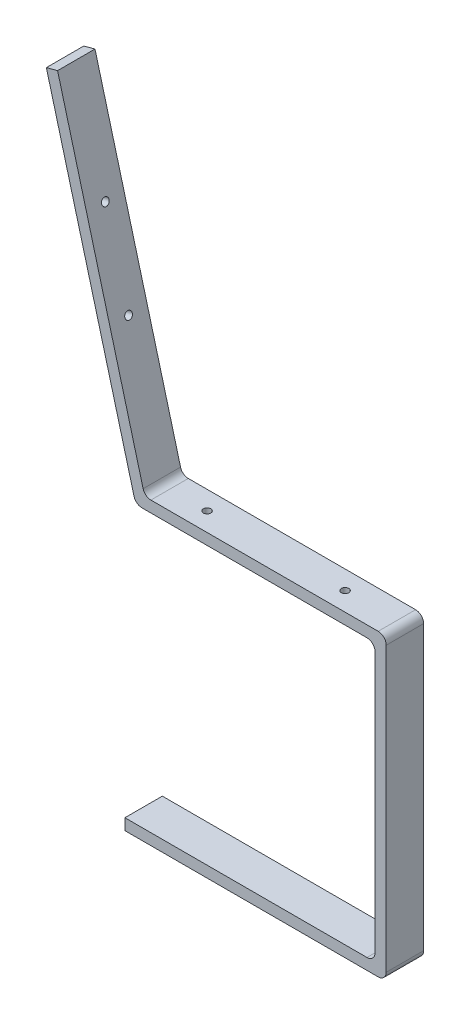
ISO-10303-21;
HEADER;
FILE_DESCRIPTION(('STEP AP214'),'2;1');
FILE_NAME('part.step','',(''),(''),'','','');
FILE_SCHEMA(('AUTOMOTIVE_DESIGN { 1 0 10303 214 1 1 1 1 }'));
ENDSEC;
DATA;
#1=APPLICATION_CONTEXT('core data for automotive mechanical design processes');
#2=APPLICATION_PROTOCOL_DEFINITION('international standard','automotive_design',2000,#1);
#3=PRODUCT_CONTEXT('',#1,'mechanical');
#4=PRODUCT('Part','Part','',(#3));
#5=PRODUCT_RELATED_PRODUCT_CATEGORY('part','',(#4));
#6=PRODUCT_DEFINITION_FORMATION('','',#4);
#7=PRODUCT_DEFINITION_CONTEXT('part definition',#1,'design');
#8=PRODUCT_DEFINITION('design','',#6,#7);
#9=PRODUCT_DEFINITION_SHAPE('','',#8);
#10=(LENGTH_UNIT() NAMED_UNIT(*) SI_UNIT(.MILLI.,.METRE.));
#11=(NAMED_UNIT(*) PLANE_ANGLE_UNIT() SI_UNIT($,.RADIAN.));
#12=(NAMED_UNIT(*) SI_UNIT($,.STERADIAN.) SOLID_ANGLE_UNIT());
#13=UNCERTAINTY_MEASURE_WITH_UNIT(LENGTH_MEASURE(1.E-05),#10,'distance_accuracy_value','');
#14=(GEOMETRIC_REPRESENTATION_CONTEXT(3) GLOBAL_UNCERTAINTY_ASSIGNED_CONTEXT((#13)) GLOBAL_UNIT_ASSIGNED_CONTEXT((#10,
#11,#12)) REPRESENTATION_CONTEXT('',''));
#15=CARTESIAN_POINT('',(0.,0.,0.));
#16=DIRECTION('',(0.,0.,1.));
#17=DIRECTION('',(1.,0.,0.));
#18=AXIS2_PLACEMENT_3D('',#15,#16,#17);
#19=CARTESIAN_POINT('',(-390.112163795705,-26.3310638998378,25.));
#20=DIRECTION('',(0.,0.,-1.));
#21=DIRECTION('',(-1.,0.,0.));
#22=AXIS2_PLACEMENT_3D('',#19,#20,#21);
#23=CYLINDRICAL_SURFACE('',#22,10.74);
#24=CARTESIAN_POINT('',(-390.112163795705,-26.3310638998378,-25.));
#25=DIRECTION('',(0.,0.,1.));
#26=DIRECTION('',(1.,0.,0.));
#27=AXIS2_PLACEMENT_3D('',#24,#25,#26);
#28=CIRCLE('',#27,10.74);
#29=CARTESIAN_POINT('',(-400.48638754957,-29.1101071713157,-25.));
#30=VERTEX_POINT('',#29);
#31=CARTESIAN_POINT('',(-390.112163795705,-37.0710638998378,-25.));
#32=VERTEX_POINT('',#31);
#33=EDGE_CURVE('E180',#30,#32,#28,.T.);
#34=ORIENTED_EDGE('',*,*,#33,.T.);
#35=DIRECTION('',(0.,0.,-1.));
#36=VECTOR('',#35,1.);
#37=CARTESIAN_POINT('',(-390.112163795705,-37.0710638998378,25.));
#38=LINE('',#37,#36);
#39=CARTESIAN_POINT('',(-390.112163795705,-37.0710638998378,25.));
#40=VERTEX_POINT('',#39);
#41=EDGE_CURVE('E11',#40,#32,#38,.T.);
#42=ORIENTED_EDGE('',*,*,#41,.F.);
#43=CARTESIAN_POINT('',(-390.112163795705,-26.3310638998378,25.));
#44=DIRECTION('',(0.,0.,1.));
#45=DIRECTION('',(1.,0.,0.));
#46=AXIS2_PLACEMENT_3D('',#43,#44,#45);
#47=CIRCLE('',#46,10.74);
#48=CARTESIAN_POINT('',(-400.48638754957,-29.1101071713157,25.));
#49=VERTEX_POINT('',#48);
#50=EDGE_CURVE('E220',#49,#40,#47,.T.);
#51=ORIENTED_EDGE('',*,*,#50,.F.);
#52=DIRECTION('',(0.,0.,-1.));
#53=VECTOR('',#52,1.);
#54=CARTESIAN_POINT('',(-400.48638754957,-29.1101071713157,25.));
#55=LINE('',#54,#53);
#56=EDGE_CURVE('E176',#49,#30,#55,.T.);
#57=ORIENTED_EDGE('',*,*,#56,.T.);
#58=EDGE_LOOP('',(#34,#42,#51,#57));
#59=FACE_BOUND('',#58,.T.);
#60=ADVANCED_FACE('F33',(#59),#23,.T.);
#61=CARTESIAN_POINT('',(-390.112163795705,-37.0710638998378,25.));
#62=DIRECTION('',(0.,1.,0.));
#63=DIRECTION('',(0.,0.,1.));
#64=AXIS2_PLACEMENT_3D('',#61,#62,#63);
#65=PLANE('',#64);
#66=CARTESIAN_POINT('',(-327.977212352975,-37.0710638998378,0.));
#67=DIRECTION('',(0.,1.,0.));
#68=DIRECTION('',(0.,0.,1.));
#69=AXIS2_PLACEMENT_3D('',#66,#67,#68);
#70=CIRCLE('',#69,4.99999999999999);
#71=CARTESIAN_POINT('',(-327.977212352975,-37.0710638998378,4.99999999999999));
#72=VERTEX_POINT('',#71);
#73=EDGE_CURVE('E184',#72,#72,#70,.T.);
#74=ORIENTED_EDGE('',*,*,#73,.T.);
#75=EDGE_LOOP('',(#74));
#76=FACE_BOUND('',#75,.T.);
#77=CARTESIAN_POINT('',(-143.507234395194,-37.0710638998378,0.));
#78=DIRECTION('',(0.,1.,0.));
#79=DIRECTION('',(0.,0.,1.));
#80=AXIS2_PLACEMENT_3D('',#77,#78,#79);
#81=CIRCLE('',#80,4.99999999999999);
#82=CARTESIAN_POINT('',(-143.507234395194,-37.0710638998378,4.99999999999996));
#83=VERTEX_POINT('',#82);
#84=EDGE_CURVE('E264',#83,#83,#81,.T.);
#85=ORIENTED_EDGE('',*,*,#84,.T.);
#86=EDGE_LOOP('',(#85));
#87=FACE_BOUND('',#86,.T.);
#88=DIRECTION('',(1.,0.,0.));
#89=VECTOR('',#88,1.);
#90=CARTESIAN_POINT('',(-390.112163795705,-37.0710638998378,-25.));
#91=LINE('',#90,#89);
#92=CARTESIAN_POINT('',(-89.2472343951937,-37.0710638998378,-25.));
#93=VERTEX_POINT('',#92);
#94=EDGE_CURVE('E183',#32,#93,#91,.T.);
#95=ORIENTED_EDGE('',*,*,#94,.T.);
#96=DIRECTION('',(0.,0.,-1.));
#97=VECTOR('',#96,1.);
#98=CARTESIAN_POINT('',(-89.2472343951937,-37.0710638998378,25.));
#99=LINE('',#98,#97);
#100=CARTESIAN_POINT('',(-89.2472343951937,-37.0710638998378,25.));
#101=VERTEX_POINT('',#100);
#102=EDGE_CURVE('E42',#101,#93,#99,.T.);
#103=ORIENTED_EDGE('',*,*,#102,.F.);
#104=DIRECTION('',(1.,0.,0.));
#105=VECTOR('',#104,1.);
#106=CARTESIAN_POINT('',(-390.112163795705,-37.0710638998378,25.));
#107=LINE('',#106,#105);
#108=EDGE_CURVE('E118',#40,#101,#107,.T.);
#109=ORIENTED_EDGE('',*,*,#108,.F.);
#110=ORIENTED_EDGE('',*,*,#41,.T.);
#111=EDGE_LOOP('',(#95,#103,#109,#110));
#112=FACE_BOUND('',#111,.T.);
#113=ADVANCED_FACE('F326',(#76,#87,#112),#65,.F.);
#114=CARTESIAN_POINT('',(-89.2472343951936,-47.8110638998378,25.));
#115=DIRECTION('',(0.,0.,-1.));
#116=DIRECTION('',(-1.,0.,0.));
#117=AXIS2_PLACEMENT_3D('',#114,#115,#116);
#118=CYLINDRICAL_SURFACE('',#117,10.74);
#119=CARTESIAN_POINT('',(-89.2472343951936,-47.8110638998378,-25.));
#120=DIRECTION('',(0.,0.,-1.));
#121=DIRECTION('',(-1.,0.,0.));
#122=AXIS2_PLACEMENT_3D('',#119,#120,#121);
#123=CIRCLE('',#122,10.74);
#124=CARTESIAN_POINT('',(-78.5072343951936,-47.8110638998379,-25.));
#125=VERTEX_POINT('',#124);
#126=EDGE_CURVE('E186',#93,#125,#123,.T.);
#127=ORIENTED_EDGE('',*,*,#126,.T.);
#128=DIRECTION('',(0.,0.,-1.));
#129=VECTOR('',#128,1.);
#130=CARTESIAN_POINT('',(-78.5072343951936,-47.8110638998379,25.));
#131=LINE('',#130,#129);
#132=CARTESIAN_POINT('',(-78.5072343951936,-47.8110638998379,25.));
#133=VERTEX_POINT('',#132);
#134=EDGE_CURVE('E242',#133,#125,#131,.T.);
#135=ORIENTED_EDGE('',*,*,#134,.F.);
#136=CARTESIAN_POINT('',(-89.2472343951936,-47.8110638998378,25.));
#137=DIRECTION('',(0.,0.,-1.));
#138=DIRECTION('',(-1.,0.,0.));
#139=AXIS2_PLACEMENT_3D('',#136,#137,#138);
#140=CIRCLE('',#139,10.74);
#141=EDGE_CURVE('E273',#101,#133,#140,.T.);
#142=ORIENTED_EDGE('',*,*,#141,.F.);
#143=ORIENTED_EDGE('',*,*,#102,.T.);
#144=EDGE_LOOP('',(#127,#135,#142,#143));
#145=FACE_BOUND('',#144,.T.);
#146=ADVANCED_FACE('F331',(#145),#118,.F.);
#147=CARTESIAN_POINT('',(-78.5072343951936,-47.8110638998379,25.));
#148=DIRECTION('',(1.,0.,0.));
#149=DIRECTION('',(0.,1.,0.));
#150=AXIS2_PLACEMENT_3D('',#147,#148,#149);
#151=PLANE('',#150);
#152=DIRECTION('',(0.,-1.,0.));
#153=VECTOR('',#152,1.);
#154=CARTESIAN_POINT('',(-78.5072343951936,-47.8110638998379,-25.));
#155=LINE('',#154,#153);
#156=CARTESIAN_POINT('',(-78.5072343951936,-396.331063899838,-25.));
#157=VERTEX_POINT('',#156);
#158=EDGE_CURVE('E188',#125,#157,#155,.T.);
#159=ORIENTED_EDGE('',*,*,#158,.T.);
#160=DIRECTION('',(0.,0.,-1.));
#161=VECTOR('',#160,1.);
#162=CARTESIAN_POINT('',(-78.5072343951936,-396.331063899838,25.));
#163=LINE('',#162,#161);
#164=CARTESIAN_POINT('',(-78.5072343951936,-396.331063899838,25.));
#165=VERTEX_POINT('',#164);
#166=EDGE_CURVE('E240',#165,#157,#163,.T.);
#167=ORIENTED_EDGE('',*,*,#166,.F.);
#168=DIRECTION('',(0.,-1.,0.));
#169=VECTOR('',#168,1.);
#170=CARTESIAN_POINT('',(-78.5072343951936,-47.8110638998379,25.));
#171=LINE('',#170,#169);
#172=EDGE_CURVE('E275',#133,#165,#171,.T.);
#173=ORIENTED_EDGE('',*,*,#172,.F.);
#174=ORIENTED_EDGE('',*,*,#134,.T.);
#175=EDGE_LOOP('',(#159,#167,#173,#174));
#176=FACE_BOUND('',#175,.T.);
#177=ADVANCED_FACE('F345',(#176),#151,.F.);
#178=CARTESIAN_POINT('',(-89.2472343951936,-396.331063899838,25.));
#179=DIRECTION('',(0.,0.,-1.));
#180=DIRECTION('',(-1.,0.,0.));
#181=AXIS2_PLACEMENT_3D('',#178,#179,#180);
#182=CYLINDRICAL_SURFACE('',#181,10.74);
#183=CARTESIAN_POINT('',(-89.2472343951936,-396.331063899838,-25.));
#184=DIRECTION('',(0.,0.,1.));
#185=DIRECTION('',(1.,0.,0.));
#186=AXIS2_PLACEMENT_3D('',#183,#184,#185);
#187=CIRCLE('',#186,10.74);
#188=CARTESIAN_POINT('',(-89.2472343951937,-407.071063899838,-25.));
#189=VERTEX_POINT('',#188);
#190=EDGE_CURVE('E191',#189,#157,#187,.T.);
#191=ORIENTED_EDGE('',*,*,#190,.F.);
#192=DIRECTION('',(0.,0.,-1.));
#193=VECTOR('',#192,1.);
#194=CARTESIAN_POINT('',(-89.2472343951937,-407.071063899838,25.));
#195=LINE('',#194,#193);
#196=CARTESIAN_POINT('',(-89.2472343951937,-407.071063899838,25.));
#197=VERTEX_POINT('',#196);
#198=EDGE_CURVE('E238',#197,#189,#195,.T.);
#199=ORIENTED_EDGE('',*,*,#198,.F.);
#200=CARTESIAN_POINT('',(-89.2472343951936,-396.331063899838,25.));
#201=DIRECTION('',(0.,0.,1.));
#202=DIRECTION('',(1.,0.,0.));
#203=AXIS2_PLACEMENT_3D('',#200,#201,#202);
#204=CIRCLE('',#203,10.74);
#205=EDGE_CURVE('E277',#197,#165,#204,.T.);
#206=ORIENTED_EDGE('',*,*,#205,.T.);
#207=ORIENTED_EDGE('',*,*,#166,.T.);
#208=EDGE_LOOP('',(#191,#199,#206,#207));
#209=FACE_BOUND('',#208,.T.);
#210=ADVANCED_FACE('F348',(#209),#182,.F.);
#211=CARTESIAN_POINT('',(-412.734449587786,-407.071063899838,25.));
#212=DIRECTION('',(0.,1.,0.));
#213=DIRECTION('',(0.,0.,1.));
#214=AXIS2_PLACEMENT_3D('',#211,#212,#213);
#215=PLANE('',#214);
#216=DIRECTION('',(1.,0.,0.));
#217=VECTOR('',#216,1.);
#218=CARTESIAN_POINT('',(-412.734449587786,-407.071063899838,-25.));
#219=LINE('',#218,#217);
#220=CARTESIAN_POINT('',(-412.734449587786,-407.071063899838,-25.));
#221=VERTEX_POINT('',#220);
#222=EDGE_CURVE('E194',#221,#189,#219,.T.);
#223=ORIENTED_EDGE('',*,*,#222,.F.);
#224=DIRECTION('',(0.,0.,-1.));
#225=VECTOR('',#224,1.);
#226=CARTESIAN_POINT('',(-412.734449587786,-407.071063899838,25.));
#227=LINE('',#226,#225);
#228=CARTESIAN_POINT('',(-412.734449587786,-407.071063899838,25.));
#229=VERTEX_POINT('',#228);
#230=EDGE_CURVE('E236',#229,#221,#227,.T.);
#231=ORIENTED_EDGE('',*,*,#230,.F.);
#232=DIRECTION('',(1.,0.,0.));
#233=VECTOR('',#232,1.);
#234=CARTESIAN_POINT('',(-412.734449587786,-407.071063899838,25.));
#235=LINE('',#234,#233);
#236=EDGE_CURVE('E280',#229,#197,#235,.T.);
#237=ORIENTED_EDGE('',*,*,#236,.T.);
#238=ORIENTED_EDGE('',*,*,#198,.T.);
#239=EDGE_LOOP('',(#223,#231,#237,#238));
#240=FACE_BOUND('',#239,.T.);
#241=ADVANCED_FACE('F351',(#240),#215,.T.);
#242=CARTESIAN_POINT('',(-412.734449587786,-422.071063899838,25.));
#243=DIRECTION('',(-1.,0.,0.));
#244=DIRECTION('',(0.,0.,1.));
#245=AXIS2_PLACEMENT_3D('',#242,#243,#244);
#246=PLANE('',#245);
#247=DIRECTION('',(0.,1.,0.));
#248=VECTOR('',#247,1.);
#249=CARTESIAN_POINT('',(-412.734449587786,-422.071063899838,-25.));
#250=LINE('',#249,#248);
#251=CARTESIAN_POINT('',(-412.734449587786,-422.071063899838,-25.));
#252=VERTEX_POINT('',#251);
#253=EDGE_CURVE('E197',#252,#221,#250,.T.);
#254=ORIENTED_EDGE('',*,*,#253,.F.);
#255=DIRECTION('',(0.,0.,-1.));
#256=VECTOR('',#255,1.);
#257=CARTESIAN_POINT('',(-412.734449587786,-422.071063899838,25.));
#258=LINE('',#257,#256);
#259=CARTESIAN_POINT('',(-412.734449587786,-422.071063899838,25.));
#260=VERTEX_POINT('',#259);
#261=EDGE_CURVE('E234',#260,#252,#258,.T.);
#262=ORIENTED_EDGE('',*,*,#261,.F.);
#263=DIRECTION('',(0.,1.,0.));
#264=VECTOR('',#263,1.);
#265=CARTESIAN_POINT('',(-412.734449587786,-422.071063899838,25.));
#266=LINE('',#265,#264);
#267=EDGE_CURVE('E283',#260,#229,#266,.T.);
#268=ORIENTED_EDGE('',*,*,#267,.T.);
#269=ORIENTED_EDGE('',*,*,#230,.T.);
#270=EDGE_LOOP('',(#254,#262,#268,#269));
#271=FACE_BOUND('',#270,.T.);
#272=ADVANCED_FACE('F355',(#271),#246,.T.);
#273=CARTESIAN_POINT('',(-412.734449587786,-422.071063899838,25.));
#274=DIRECTION('',(0.,1.,0.));
#275=DIRECTION('',(0.,0.,1.));
#276=AXIS2_PLACEMENT_3D('',#273,#274,#275);
#277=PLANE('',#276);
#278=DIRECTION('',(1.,0.,0.));
#279=VECTOR('',#278,1.);
#280=CARTESIAN_POINT('',(-412.734449587786,-422.071063899838,-25.));
#281=LINE('',#280,#279);
#282=CARTESIAN_POINT('',(-74.2472343951937,-422.071063899838,-25.));
#283=VERTEX_POINT('',#282);
#284=EDGE_CURVE('E200',#252,#283,#281,.T.);
#285=ORIENTED_EDGE('',*,*,#284,.T.);
#286=DIRECTION('',(0.,0.,-1.));
#287=VECTOR('',#286,1.);
#288=CARTESIAN_POINT('',(-74.2472343951937,-422.071063899838,25.));
#289=LINE('',#288,#287);
#290=CARTESIAN_POINT('',(-74.2472343951937,-422.071063899838,25.));
#291=VERTEX_POINT('',#290);
#292=EDGE_CURVE('E232',#291,#283,#289,.T.);
#293=ORIENTED_EDGE('',*,*,#292,.F.);
#294=DIRECTION('',(1.,0.,0.));
#295=VECTOR('',#294,1.);
#296=CARTESIAN_POINT('',(-412.734449587786,-422.071063899838,25.));
#297=LINE('',#296,#295);
#298=EDGE_CURVE('E286',#260,#291,#297,.T.);
#299=ORIENTED_EDGE('',*,*,#298,.F.);
#300=ORIENTED_EDGE('',*,*,#261,.T.);
#301=EDGE_LOOP('',(#285,#293,#299,#300));
#302=FACE_BOUND('',#301,.T.);
#303=ADVANCED_FACE('F360',(#302),#277,.F.);
#304=CARTESIAN_POINT('',(-74.2472343951936,-411.331063899838,25.));
#305=DIRECTION('',(0.,0.,-1.));
#306=DIRECTION('',(-1.,0.,0.));
#307=AXIS2_PLACEMENT_3D('',#304,#305,#306);
#308=CYLINDRICAL_SURFACE('',#307,10.74);
#309=CARTESIAN_POINT('',(-74.2472343951936,-411.331063899838,-25.));
#310=DIRECTION('',(0.,0.,-1.));
#311=DIRECTION('',(-1.,0.,0.));
#312=AXIS2_PLACEMENT_3D('',#309,#310,#311);
#313=CIRCLE('',#312,10.74);
#314=CARTESIAN_POINT('',(-63.5072343951936,-411.331063899838,-25.));
#315=VERTEX_POINT('',#314);
#316=EDGE_CURVE('E203',#315,#283,#313,.T.);
#317=ORIENTED_EDGE('',*,*,#316,.F.);
#318=DIRECTION('',(0.,0.,-1.));
#319=VECTOR('',#318,1.);
#320=CARTESIAN_POINT('',(-63.5072343951936,-411.331063899838,25.));
#321=LINE('',#320,#319);
#322=CARTESIAN_POINT('',(-63.5072343951936,-411.331063899838,25.));
#323=VERTEX_POINT('',#322);
#324=EDGE_CURVE('E230',#323,#315,#321,.T.);
#325=ORIENTED_EDGE('',*,*,#324,.F.);
#326=CARTESIAN_POINT('',(-74.2472343951936,-411.331063899838,25.));
#327=DIRECTION('',(0.,0.,-1.));
#328=DIRECTION('',(-1.,0.,0.));
#329=AXIS2_PLACEMENT_3D('',#326,#327,#328);
#330=CIRCLE('',#329,10.74);
#331=EDGE_CURVE('E288',#323,#291,#330,.T.);
#332=ORIENTED_EDGE('',*,*,#331,.T.);
#333=ORIENTED_EDGE('',*,*,#292,.T.);
#334=EDGE_LOOP('',(#317,#325,#332,#333));
#335=FACE_BOUND('',#334,.T.);
#336=ADVANCED_FACE('F365',(#335),#308,.T.);
#337=CARTESIAN_POINT('',(-63.5072343951936,-32.8110638998379,25.));
#338=DIRECTION('',(1.,0.,0.));
#339=DIRECTION('',(0.,1.,0.));
#340=AXIS2_PLACEMENT_3D('',#337,#338,#339);
#341=PLANE('',#340);
#342=DIRECTION('',(0.,-1.,0.));
#343=VECTOR('',#342,1.);
#344=CARTESIAN_POINT('',(-63.5072343951936,-32.8110638998379,-25.));
#345=LINE('',#344,#343);
#346=CARTESIAN_POINT('',(-63.5072343951936,-32.8110638998379,-25.));
#347=VERTEX_POINT('',#346);
#348=EDGE_CURVE('E206',#347,#315,#345,.T.);
#349=ORIENTED_EDGE('',*,*,#348,.F.);
#350=DIRECTION('',(0.,0.,-1.));
#351=VECTOR('',#350,1.);
#352=CARTESIAN_POINT('',(-63.5072343951936,-32.8110638998379,25.));
#353=LINE('',#352,#351);
#354=CARTESIAN_POINT('',(-63.5072343951936,-32.8110638998379,25.));
#355=VERTEX_POINT('',#354);
#356=EDGE_CURVE('E228',#355,#347,#353,.T.);
#357=ORIENTED_EDGE('',*,*,#356,.F.);
#358=DIRECTION('',(0.,-1.,0.));
#359=VECTOR('',#358,1.);
#360=CARTESIAN_POINT('',(-63.5072343951936,-32.8110638998379,25.));
#361=LINE('',#360,#359);
#362=EDGE_CURVE('E291',#355,#323,#361,.T.);
#363=ORIENTED_EDGE('',*,*,#362,.T.);
#364=ORIENTED_EDGE('',*,*,#324,.T.);
#365=EDGE_LOOP('',(#349,#357,#363,#364));
#366=FACE_BOUND('',#365,.T.);
#367=ADVANCED_FACE('F363',(#366),#341,.T.);
#368=CARTESIAN_POINT('',(-74.2472343951937,-32.8110638998378,25.));
#369=DIRECTION('',(0.,0.,-1.));
#370=DIRECTION('',(-1.,0.,0.));
#371=AXIS2_PLACEMENT_3D('',#368,#369,#370);
#372=CYLINDRICAL_SURFACE('',#371,10.74);
#373=CARTESIAN_POINT('',(-74.2472343951937,-32.8110638998378,-25.));
#374=DIRECTION('',(0.,0.,-1.));
#375=DIRECTION('',(-1.,0.,0.));
#376=AXIS2_PLACEMENT_3D('',#373,#374,#375);
#377=CIRCLE('',#376,10.74);
#378=CARTESIAN_POINT('',(-74.2472343951937,-22.0710638998378,-25.));
#379=VERTEX_POINT('',#378);
#380=EDGE_CURVE('E209',#379,#347,#377,.T.);
#381=ORIENTED_EDGE('',*,*,#380,.F.);
#382=DIRECTION('',(0.,0.,-1.));
#383=VECTOR('',#382,1.);
#384=CARTESIAN_POINT('',(-74.2472343951937,-22.0710638998378,25.));
#385=LINE('',#384,#383);
#386=CARTESIAN_POINT('',(-74.2472343951937,-22.0710638998378,25.));
#387=VERTEX_POINT('',#386);
#388=EDGE_CURVE('E226',#387,#379,#385,.T.);
#389=ORIENTED_EDGE('',*,*,#388,.F.);
#390=CARTESIAN_POINT('',(-74.2472343951937,-32.8110638998378,25.));
#391=DIRECTION('',(0.,0.,-1.));
#392=DIRECTION('',(-1.,0.,0.));
#393=AXIS2_PLACEMENT_3D('',#390,#391,#392);
#394=CIRCLE('',#393,10.74);
#395=EDGE_CURVE('E294',#387,#355,#394,.T.);
#396=ORIENTED_EDGE('',*,*,#395,.T.);
#397=ORIENTED_EDGE('',*,*,#356,.T.);
#398=EDGE_LOOP('',(#381,#389,#396,#397));
#399=FACE_BOUND('',#398,.T.);
#400=ADVANCED_FACE('F307',(#399),#372,.T.);
#401=CARTESIAN_POINT('',(-378.024005722299,-22.0710638998378,25.));
#402=DIRECTION('',(0.,1.,0.));
#403=DIRECTION('',(0.,0.,1.));
#404=AXIS2_PLACEMENT_3D('',#401,#402,#403);
#405=PLANE('',#404);
#406=CARTESIAN_POINT('',(-327.977212352975,-22.0710638998378,0.));
#407=DIRECTION('',(0.,1.,0.));
#408=DIRECTION('',(0.,0.,1.));
#409=AXIS2_PLACEMENT_3D('',#406,#407,#408);
#410=CIRCLE('',#409,4.99999999999999);
#411=CARTESIAN_POINT('',(-327.977212352975,-22.0710638998378,4.99999999999999));
#412=VERTEX_POINT('',#411);
#413=EDGE_CURVE('E261',#412,#412,#410,.T.);
#414=ORIENTED_EDGE('',*,*,#413,.F.);
#415=EDGE_LOOP('',(#414));
#416=FACE_BOUND('',#415,.T.);
#417=CARTESIAN_POINT('',(-143.507234395194,-22.0710638998378,0.));
#418=DIRECTION('',(0.,1.,0.));
#419=DIRECTION('',(0.,0.,1.));
#420=AXIS2_PLACEMENT_3D('',#417,#418,#419);
#421=CIRCLE('',#420,4.99999999999999);
#422=CARTESIAN_POINT('',(-143.507234395194,-22.0710638998378,4.99999999999996));
#423=VERTEX_POINT('',#422);
#424=EDGE_CURVE('E252',#423,#423,#421,.T.);
#425=ORIENTED_EDGE('',*,*,#424,.F.);
#426=EDGE_LOOP('',(#425));
#427=FACE_BOUND('',#426,.T.);
#428=DIRECTION('',(1.,0.,0.));
#429=VECTOR('',#428,1.);
#430=CARTESIAN_POINT('',(-378.024005722299,-22.0710638998378,-25.));
#431=LINE('',#430,#429);
#432=CARTESIAN_POINT('',(-378.024005722299,-22.0710638998378,-25.));
#433=VERTEX_POINT('',#432);
#434=EDGE_CURVE('E212',#433,#379,#431,.T.);
#435=ORIENTED_EDGE('',*,*,#434,.F.);
#436=DIRECTION('',(0.,0.,-1.));
#437=VECTOR('',#436,1.);
#438=CARTESIAN_POINT('',(-378.024005722299,-22.0710638998378,25.));
#439=LINE('',#438,#437);
#440=CARTESIAN_POINT('',(-378.024005722299,-22.0710638998378,25.));
#441=VERTEX_POINT('',#440);
#442=EDGE_CURVE('E224',#441,#433,#439,.T.);
#443=ORIENTED_EDGE('',*,*,#442,.F.);
#444=DIRECTION('',(1.,0.,0.));
#445=VECTOR('',#444,1.);
#446=CARTESIAN_POINT('',(-378.024005722299,-22.0710638998378,25.));
#447=LINE('',#446,#445);
#448=EDGE_CURVE('E297',#441,#387,#447,.T.);
#449=ORIENTED_EDGE('',*,*,#448,.T.);
#450=ORIENTED_EDGE('',*,*,#388,.T.);
#451=EDGE_LOOP('',(#435,#443,#449,#450));
#452=FACE_BOUND('',#451,.T.);
#453=ADVANCED_FACE('F301',(#416,#427,#452),#405,.T.);
#454=CARTESIAN_POINT('',(-378.024005722299,-11.3310638998378,25.));
#455=DIRECTION('',(0.,0.,-1.));
#456=DIRECTION('',(-1.,0.,0.));
#457=AXIS2_PLACEMENT_3D('',#454,#455,#456);
#458=CYLINDRICAL_SURFACE('',#457,10.74);
#459=CARTESIAN_POINT('',(-378.024005722299,-11.3310638998378,-25.));
#460=DIRECTION('',(0.,0.,-1.));
#461=DIRECTION('',(-1.,0.,0.));
#462=AXIS2_PLACEMENT_3D('',#459,#460,#461);
#463=CIRCLE('',#462,10.74);
#464=CARTESIAN_POINT('',(-388.398049096644,-14.1107804442389,-25.));
#465=VERTEX_POINT('',#464);
#466=EDGE_CURVE('E215',#433,#465,#463,.T.);
#467=ORIENTED_EDGE('',*,*,#466,.T.);
#468=DIRECTION('',(0.,0.,-1.));
#469=VECTOR('',#468,1.);
#470=CARTESIAN_POINT('',(-388.398049096644,-14.1107804442389,25.));
#471=LINE('',#470,#469);
#472=CARTESIAN_POINT('',(-388.398049096644,-14.1107804442389,25.));
#473=VERTEX_POINT('',#472);
#474=EDGE_CURVE('E171',#473,#465,#471,.T.);
#475=ORIENTED_EDGE('',*,*,#474,.F.);
#476=CARTESIAN_POINT('',(-378.024005722299,-11.3310638998378,25.));
#477=DIRECTION('',(0.,0.,-1.));
#478=DIRECTION('',(-1.,0.,0.));
#479=AXIS2_PLACEMENT_3D('',#476,#477,#478);
#480=CIRCLE('',#479,10.74);
#481=EDGE_CURVE('E162',#441,#473,#480,.T.);
#482=ORIENTED_EDGE('',*,*,#481,.F.);
#483=ORIENTED_EDGE('',*,*,#442,.T.);
#484=EDGE_LOOP('',(#467,#475,#482,#483));
#485=FACE_BOUND('',#484,.T.);
#486=ADVANCED_FACE('F314',(#485),#458,.F.);
#487=CARTESIAN_POINT('',(-388.398049096644,-14.1107804442389,25.));
#488=DIRECTION('',(-0.965925826289067,-0.258819045102525,0.));
#489=DIRECTION('',(0.258819045102525,-0.965925826289067,0.));
#490=AXIS2_PLACEMENT_3D('',#487,#488,#489);
#491=PLANE('',#490);
#492=CARTESIAN_POINT('',(-463.910811103951,267.706683986882,0.));
#493=DIRECTION('',(0.965925826289067,0.258819045102525,0.));
#494=DIRECTION('',(-0.258819045102525,0.965925826289067,0.));
#495=AXIS2_PLACEMENT_3D('',#492,#493,#494);
#496=CIRCLE('',#495,5.);
#497=CARTESIAN_POINT('',(-465.204906329463,272.536313118328,0.));
#498=VERTEX_POINT('',#497);
#499=EDGE_CURVE('E248',#498,#498,#496,.T.);
#500=ORIENTED_EDGE('',*,*,#499,.F.);
#501=EDGE_LOOP('',(#500));
#502=FACE_BOUND('',#501,.T.);
#503=CARTESIAN_POINT('',(-432.852525691648,151.795584832194,0.));
#504=DIRECTION('',(0.965925826289067,0.258819045102525,0.));
#505=DIRECTION('',(-0.258819045102525,0.965925826289067,0.));
#506=AXIS2_PLACEMENT_3D('',#503,#504,#505);
#507=CIRCLE('',#506,5.);
#508=CARTESIAN_POINT('',(-434.14662091716,156.625213963639,0.));
#509=VERTEX_POINT('',#508);
#510=EDGE_CURVE('E254',#509,#509,#507,.T.);
#511=ORIENTED_EDGE('',*,*,#510,.F.);
#512=EDGE_LOOP('',(#511));
#513=FACE_BOUND('',#512,.T.);
#514=DIRECTION('',(-0.258819045102525,0.965925826289067,0.));
#515=VECTOR('',#514,1.);
#516=CARTESIAN_POINT('',(-388.398049096644,-14.1107804442389,-25.));
#517=LINE('',#516,#515);
#518=CARTESIAN_POINT('',(-502.73366786933,412.595557930242,-25.));
#519=VERTEX_POINT('',#518);
#520=EDGE_CURVE('E170',#465,#519,#517,.T.);
#521=ORIENTED_EDGE('',*,*,#520,.T.);
#522=DIRECTION('',(0.,0.,-1.));
#523=VECTOR('',#522,1.);
#524=CARTESIAN_POINT('',(-502.73366786933,412.595557930242,25.));
#525=LINE('',#524,#523);
#526=CARTESIAN_POINT('',(-502.73366786933,412.595557930242,25.));
#527=VERTEX_POINT('',#526);
#528=EDGE_CURVE('E167',#527,#519,#525,.T.);
#529=ORIENTED_EDGE('',*,*,#528,.F.);
#530=DIRECTION('',(-0.258819045102525,0.965925826289067,0.));
#531=VECTOR('',#530,1.);
#532=CARTESIAN_POINT('',(-388.398049096644,-14.1107804442389,25.));
#533=LINE('',#532,#531);
#534=EDGE_CURVE('E155',#473,#527,#533,.T.);
#535=ORIENTED_EDGE('',*,*,#534,.F.);
#536=ORIENTED_EDGE('',*,*,#474,.T.);
#537=EDGE_LOOP('',(#521,#529,#535,#536));
#538=FACE_BOUND('',#537,.T.);
#539=ADVANCED_FACE('F168',(#502,#513,#538),#491,.F.);
#540=CARTESIAN_POINT('',(-502.73366786933,412.595557930242,25.));
#541=DIRECTION('',(0.258819045102525,-0.965925826289067,0.));
#542=DIRECTION('',(0.965925826289067,0.258819045102525,0.));
#543=AXIS2_PLACEMENT_3D('',#540,#541,#542);
#544=PLANE('',#543);
#545=DIRECTION('',(-0.965925826289067,-0.258819045102525,0.));
#546=VECTOR('',#545,1.);
#547=CARTESIAN_POINT('',(-502.73366786933,412.595557930242,-25.));
#548=LINE('',#547,#546);
#549=CARTESIAN_POINT('',(-517.733667869329,408.576320043775,-25.));
#550=VERTEX_POINT('',#549);
#551=EDGE_CURVE('E104',#519,#550,#548,.T.);
#552=ORIENTED_EDGE('',*,*,#551,.T.);
#553=DIRECTION('',(0.,0.,-1.));
#554=VECTOR('',#553,1.);
#555=CARTESIAN_POINT('',(-517.733667869329,408.576320043775,25.));
#556=LINE('',#555,#554);
#557=CARTESIAN_POINT('',(-517.733667869329,408.576320043775,25.));
#558=VERTEX_POINT('',#557);
#559=EDGE_CURVE('E172',#558,#550,#556,.T.);
#560=ORIENTED_EDGE('',*,*,#559,.F.);
#561=DIRECTION('',(-0.965925826289067,-0.258819045102525,0.));
#562=VECTOR('',#561,1.);
#563=CARTESIAN_POINT('',(-502.73366786933,412.595557930242,25.));
#564=LINE('',#563,#562);
#565=EDGE_CURVE('E159',#527,#558,#564,.T.);
#566=ORIENTED_EDGE('',*,*,#565,.F.);
#567=ORIENTED_EDGE('',*,*,#528,.T.);
#568=EDGE_LOOP('',(#552,#560,#566,#567));
#569=FACE_BOUND('',#568,.T.);
#570=ADVANCED_FACE('F174',(#569),#544,.F.);
#571=CARTESIAN_POINT('',(-517.733667869329,408.576320043775,25.));
#572=DIRECTION('',(0.965942621402685,0.258756356748408,0.));
#573=DIRECTION('',(-0.258756356748408,0.965942621402685,0.));
#574=AXIS2_PLACEMENT_3D('',#571,#572,#573);
#575=PLANE('',#574);
#576=CARTESIAN_POINT('',(-478.920214275329,263.684926528238,0.));
#577=DIRECTION('',(0.965942621402685,0.258756356748408,0.));
#578=DIRECTION('',(-0.258756356748408,0.965942621402685,0.));
#579=AXIS2_PLACEMENT_3D('',#576,#577,#578);
#580=ELLIPSE('',#579,5.00000001052976,5.);
#581=CARTESIAN_POINT('',(-480.213996061796,268.514639645423,0.));
#582=VERTEX_POINT('',#581);
#583=EDGE_CURVE('E36',#582,#582,#580,.T.);
#584=ORIENTED_EDGE('',*,*,#583,.T.);
#585=EDGE_LOOP('',(#584));
#586=FACE_BOUND('',#585,.T.);
#587=CARTESIAN_POINT('',(-447.869451400129,147.771811715808,0.));
#588=DIRECTION('',(0.965942621402685,0.258756356748408,0.));
#589=DIRECTION('',(-0.258756356748408,0.965942621402685,0.));
#590=AXIS2_PLACEMENT_3D('',#587,#588,#589);
#591=ELLIPSE('',#590,5.00000001052976,5.);
#592=CARTESIAN_POINT('',(-449.163233186595,152.601524832993,0.));
#593=VERTEX_POINT('',#592);
#594=EDGE_CURVE('E246',#593,#593,#591,.T.);
#595=ORIENTED_EDGE('',*,*,#594,.T.);
#596=EDGE_LOOP('',(#595));
#597=FACE_BOUND('',#596,.T.);
#598=DIRECTION('',(0.258756356748408,-0.965942621402685,0.));
#599=VECTOR('',#598,1.);
#600=CARTESIAN_POINT('',(-517.733667869329,408.576320043775,-25.));
#601=LINE('',#600,#599);
#602=EDGE_CURVE('E110',#550,#30,#601,.T.);
#603=ORIENTED_EDGE('',*,*,#602,.T.);
#604=ORIENTED_EDGE('',*,*,#56,.F.);
#605=DIRECTION('',(0.258756356748408,-0.965942621402685,0.));
#606=VECTOR('',#605,1.);
#607=CARTESIAN_POINT('',(-517.733667869329,408.576320043775,25.));
#608=LINE('',#607,#606);
#609=EDGE_CURVE('E51',#558,#49,#608,.T.);
#610=ORIENTED_EDGE('',*,*,#609,.F.);
#611=ORIENTED_EDGE('',*,*,#559,.T.);
#612=EDGE_LOOP('',(#603,#604,#610,#611));
#613=FACE_BOUND('',#612,.T.);
#614=ADVANCED_FACE('F441',(#586,#597,#613),#575,.F.);
#615=CARTESIAN_POINT('',(-390.112163795705,-26.3310638998378,25.));
#616=DIRECTION('',(0.,0.,1.));
#617=DIRECTION('',(1.,0.,0.));
#618=AXIS2_PLACEMENT_3D('',#615,#616,#617);
#619=PLANE('',#618);
#620=ORIENTED_EDGE('',*,*,#50,.T.);
#621=ORIENTED_EDGE('',*,*,#108,.T.);
#622=ORIENTED_EDGE('',*,*,#141,.T.);
#623=ORIENTED_EDGE('',*,*,#172,.T.);
#624=ORIENTED_EDGE('',*,*,#205,.F.);
#625=ORIENTED_EDGE('',*,*,#236,.F.);
#626=ORIENTED_EDGE('',*,*,#267,.F.);
#627=ORIENTED_EDGE('',*,*,#298,.T.);
#628=ORIENTED_EDGE('',*,*,#331,.F.);
#629=ORIENTED_EDGE('',*,*,#362,.F.);
#630=ORIENTED_EDGE('',*,*,#395,.F.);
#631=ORIENTED_EDGE('',*,*,#448,.F.);
#632=ORIENTED_EDGE('',*,*,#481,.T.);
#633=ORIENTED_EDGE('',*,*,#534,.T.);
#634=ORIENTED_EDGE('',*,*,#565,.T.);
#635=ORIENTED_EDGE('',*,*,#609,.T.);
#636=EDGE_LOOP('',(#620,#621,#622,#623,#624,#625,#626,#627,#628,#629,#630,#631,#632,#633,#634,#635));
#637=FACE_BOUND('',#636,.T.);
#638=ADVANCED_FACE('F157',(#637),#619,.T.);
#639=CARTESIAN_POINT('',(-390.112163795705,-26.3310638998378,-25.));
#640=DIRECTION('',(0.,0.,1.));
#641=DIRECTION('',(1.,0.,0.));
#642=AXIS2_PLACEMENT_3D('',#639,#640,#641);
#643=PLANE('',#642);
#644=ORIENTED_EDGE('',*,*,#33,.F.);
#645=ORIENTED_EDGE('',*,*,#602,.F.);
#646=ORIENTED_EDGE('',*,*,#551,.F.);
#647=ORIENTED_EDGE('',*,*,#520,.F.);
#648=ORIENTED_EDGE('',*,*,#466,.F.);
#649=ORIENTED_EDGE('',*,*,#434,.T.);
#650=ORIENTED_EDGE('',*,*,#380,.T.);
#651=ORIENTED_EDGE('',*,*,#348,.T.);
#652=ORIENTED_EDGE('',*,*,#316,.T.);
#653=ORIENTED_EDGE('',*,*,#284,.F.);
#654=ORIENTED_EDGE('',*,*,#253,.T.);
#655=ORIENTED_EDGE('',*,*,#222,.T.);
#656=ORIENTED_EDGE('',*,*,#190,.T.);
#657=ORIENTED_EDGE('',*,*,#158,.F.);
#658=ORIENTED_EDGE('',*,*,#126,.F.);
#659=ORIENTED_EDGE('',*,*,#94,.F.);
#660=EDGE_LOOP('',(#644,#645,#646,#647,#648,#649,#650,#651,#652,#653,#654,#655,#656,#657,#658,#659));
#661=FACE_BOUND('',#660,.T.);
#662=ADVANCED_FACE('F312',(#661),#643,.F.);
#663=CARTESIAN_POINT('',(-143.507234395194,-42.0710638998378,0.));
#664=DIRECTION('',(0.,1.,0.));
#665=DIRECTION('',(0.,0.,1.));
#666=AXIS2_PLACEMENT_3D('',#663,#664,#665);
#667=CYLINDRICAL_SURFACE('',#666,4.99999999999999);
#668=ORIENTED_EDGE('',*,*,#424,.T.);
#669=EDGE_LOOP('',(#668));
#670=FACE_BOUND('',#669,.T.);
#671=ORIENTED_EDGE('',*,*,#84,.F.);
#672=EDGE_LOOP('',(#671));
#673=FACE_BOUND('',#672,.T.);
#674=ADVANCED_FACE('F459',(#670,#673),#667,.F.);
#675=CARTESIAN_POINT('',(-327.977212352975,-42.0710638998378,0.));
#676=DIRECTION('',(0.,1.,0.));
#677=DIRECTION('',(0.,0.,1.));
#678=AXIS2_PLACEMENT_3D('',#675,#676,#677);
#679=CYLINDRICAL_SURFACE('',#678,4.99999999999999);
#680=ORIENTED_EDGE('',*,*,#413,.T.);
#681=EDGE_LOOP('',(#680));
#682=FACE_BOUND('',#681,.T.);
#683=ORIENTED_EDGE('',*,*,#73,.F.);
#684=EDGE_LOOP('',(#683));
#685=FACE_BOUND('',#684,.T.);
#686=ADVANCED_FACE('F479',(#682,#685),#679,.F.);
#687=CARTESIAN_POINT('',(-452.171042217429,146.619203930144,0.));
#688=DIRECTION('',(0.965925826289067,0.258819045102525,0.));
#689=DIRECTION('',(-0.258819045102525,0.965925826289067,0.));
#690=AXIS2_PLACEMENT_3D('',#687,#688,#689);
#691=CYLINDRICAL_SURFACE('',#690,5.);
#692=ORIENTED_EDGE('',*,*,#510,.T.);
#693=EDGE_LOOP('',(#692));
#694=FACE_BOUND('',#693,.T.);
#695=ORIENTED_EDGE('',*,*,#594,.F.);
#696=EDGE_LOOP('',(#695));
#697=FACE_BOUND('',#696,.T.);
#698=ADVANCED_FACE('F489',(#694,#697),#691,.F.);
#699=CARTESIAN_POINT('',(-483.229327629732,262.530303084832,0.));
#700=DIRECTION('',(0.965925826289067,0.258819045102525,0.));
#701=DIRECTION('',(-0.258819045102525,0.965925826289067,0.));
#702=AXIS2_PLACEMENT_3D('',#699,#700,#701);
#703=CYLINDRICAL_SURFACE('',#702,5.);
#704=ORIENTED_EDGE('',*,*,#499,.T.);
#705=EDGE_LOOP('',(#704));
#706=FACE_BOUND('',#705,.T.);
#707=ORIENTED_EDGE('',*,*,#583,.F.);
#708=EDGE_LOOP('',(#707));
#709=FACE_BOUND('',#708,.T.);
#710=ADVANCED_FACE('F511',(#706,#709),#703,.F.);
#711=CLOSED_SHELL('',(#60,#113,#146,#177,#210,#241,#272,#303,#336,#367,#400,#453,#486,#539,#570,
#614,#638,#662,#674,#686,#698,#710));
#712=MANIFOLD_SOLID_BREP('B2',#711);
#713=ADVANCED_BREP_SHAPE_REPRESENTATION('',(#18,#712),#14);
#714=SHAPE_DEFINITION_REPRESENTATION(#9,#713);
ENDSEC;
END-ISO-10303-21;
